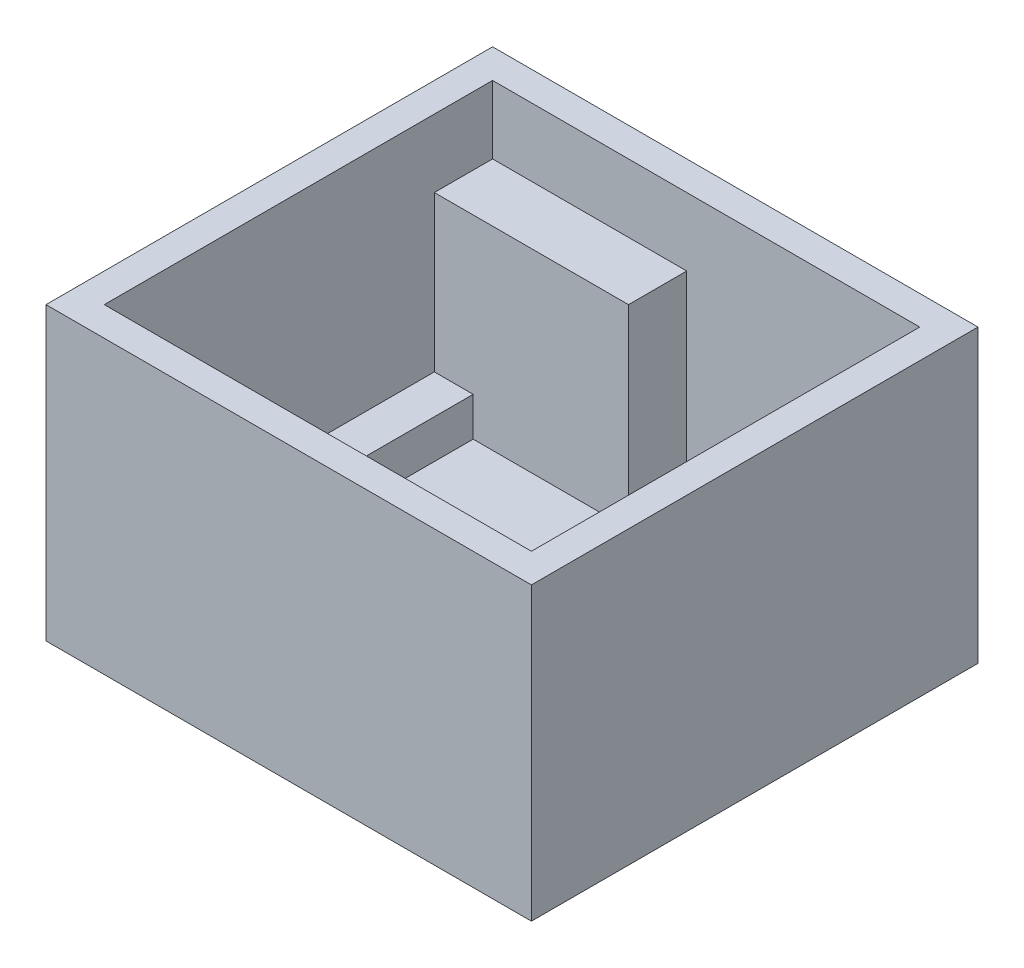
ISO-10303-21;
HEADER;
FILE_DESCRIPTION(('STEP AP214'),'2;1');
FILE_NAME('part.step','',(''),(''),'','','');
FILE_SCHEMA(('AUTOMOTIVE_DESIGN { 1 0 10303 214 1 1 1 1 }'));
ENDSEC;
DATA;
#1=APPLICATION_CONTEXT('core data for automotive mechanical design processes');
#2=APPLICATION_PROTOCOL_DEFINITION('international standard','automotive_design',2000,#1);
#3=PRODUCT_CONTEXT('',#1,'mechanical');
#4=PRODUCT('Part','Part','',(#3));
#5=PRODUCT_RELATED_PRODUCT_CATEGORY('part','',(#4));
#6=PRODUCT_DEFINITION_FORMATION('','',#4);
#7=PRODUCT_DEFINITION_CONTEXT('part definition',#1,'design');
#8=PRODUCT_DEFINITION('design','',#6,#7);
#9=PRODUCT_DEFINITION_SHAPE('','',#8);
#10=(LENGTH_UNIT() NAMED_UNIT(*) SI_UNIT(.MILLI.,.METRE.));
#11=(NAMED_UNIT(*) PLANE_ANGLE_UNIT() SI_UNIT($,.RADIAN.));
#12=(NAMED_UNIT(*) SI_UNIT($,.STERADIAN.) SOLID_ANGLE_UNIT());
#13=UNCERTAINTY_MEASURE_WITH_UNIT(LENGTH_MEASURE(1.E-05),#10,'distance_accuracy_value','');
#14=(GEOMETRIC_REPRESENTATION_CONTEXT(3) GLOBAL_UNCERTAINTY_ASSIGNED_CONTEXT((#13)) GLOBAL_UNIT_ASSIGNED_CONTEXT((#10,
#11,#12)) REPRESENTATION_CONTEXT('',''));
#15=CARTESIAN_POINT('',(0.,0.,0.));
#16=DIRECTION('',(0.,0.,1.));
#17=DIRECTION('',(1.,0.,0.));
#18=AXIS2_PLACEMENT_3D('',#15,#16,#17);
#19=CARTESIAN_POINT('',(11.,3.5,8.00000000000001));
#20=DIRECTION('',(0.,0.,1.));
#21=DIRECTION('',(1.,0.,0.));
#22=AXIS2_PLACEMENT_3D('',#19,#20,#21);
#23=PLANE('',#22);
#24=DIRECTION('',(0.,-1.,0.));
#25=VECTOR('',#24,1.);
#26=CARTESIAN_POINT('',(9.78113883008419,3.5,8.00000000000001));
#27=LINE('',#26,#25);
#28=CARTESIAN_POINT('',(9.78113883008419,3.5,8.00000000000001));
#29=VERTEX_POINT('',#28);
#30=CARTESIAN_POINT('',(9.78113883008419,1.5,8.00000000000001));
#31=VERTEX_POINT('',#30);
#32=EDGE_CURVE('E200',#29,#31,#27,.T.);
#33=ORIENTED_EDGE('',*,*,#32,.F.);
#34=DIRECTION('',(-1.,0.,0.));
#35=VECTOR('',#34,1.);
#36=CARTESIAN_POINT('',(11.,3.5,8.00000000000001));
#37=LINE('',#36,#35);
#38=CARTESIAN_POINT('',(11.,3.5,8.00000000000001));
#39=VERTEX_POINT('',#38);
#40=EDGE_CURVE('E211',#39,#29,#37,.T.);
#41=ORIENTED_EDGE('',*,*,#40,.F.);
#42=DIRECTION('',(0.,-1.,0.));
#43=VECTOR('',#42,1.);
#44=CARTESIAN_POINT('',(11.,3.5,8.00000000000001));
#45=LINE('',#44,#43);
#46=CARTESIAN_POINT('',(11.,1.5,8.00000000000001));
#47=VERTEX_POINT('',#46);
#48=EDGE_CURVE('E235',#39,#47,#45,.T.);
#49=ORIENTED_EDGE('',*,*,#48,.T.);
#50=DIRECTION('',(-1.,0.,0.));
#51=VECTOR('',#50,1.);
#52=CARTESIAN_POINT('',(11.,1.5,8.00000000000001));
#53=LINE('',#52,#51);
#54=EDGE_CURVE('E213',#47,#31,#53,.T.);
#55=ORIENTED_EDGE('',*,*,#54,.T.);
#56=EDGE_LOOP('',(#33,#41,#49,#55));
#57=FACE_BOUND('',#56,.T.);
#58=ADVANCED_FACE('F33',(#57),#23,.F.);
#59=CARTESIAN_POINT('',(9.,3.5,10.));
#60=DIRECTION('',(1.,0.,0.));
#61=DIRECTION('',(0.,0.,-1.));
#62=AXIS2_PLACEMENT_3D('',#59,#60,#61);
#63=PLANE('',#62);
#64=DIRECTION('',(0.,-1.,0.));
#65=VECTOR('',#64,1.);
#66=CARTESIAN_POINT('',(9.,3.5,8.80643824162734));
#67=LINE('',#66,#65);
#68=CARTESIAN_POINT('',(9.,1.5,8.80643824162734));
#69=VERTEX_POINT('',#68);
#70=CARTESIAN_POINT('',(9.,3.5,8.80643824162734));
#71=VERTEX_POINT('',#70);
#72=EDGE_CURVE('E203',#69,#71,#67,.F.);
#73=ORIENTED_EDGE('',*,*,#72,.F.);
#74=DIRECTION('',(0.,0.,1.));
#75=VECTOR('',#74,1.);
#76=CARTESIAN_POINT('',(9.,1.5,10.));
#77=LINE('',#76,#75);
#78=CARTESIAN_POINT('',(9.,1.5,10.));
#79=VERTEX_POINT('',#78);
#80=EDGE_CURVE('E224',#69,#79,#77,.T.);
#81=ORIENTED_EDGE('',*,*,#80,.T.);
#82=DIRECTION('',(0.,-1.,0.));
#83=VECTOR('',#82,1.);
#84=CARTESIAN_POINT('',(9.,3.5,10.));
#85=LINE('',#84,#83);
#86=CARTESIAN_POINT('',(9.,3.5,10.));
#87=VERTEX_POINT('',#86);
#88=EDGE_CURVE('E229',#87,#79,#85,.T.);
#89=ORIENTED_EDGE('',*,*,#88,.F.);
#90=DIRECTION('',(0.,0.,1.));
#91=VECTOR('',#90,1.);
#92=CARTESIAN_POINT('',(9.,3.5,10.));
#93=LINE('',#92,#91);
#94=EDGE_CURVE('E220',#71,#87,#93,.T.);
#95=ORIENTED_EDGE('',*,*,#94,.F.);
#96=EDGE_LOOP('',(#73,#81,#89,#95));
#97=FACE_BOUND('',#96,.T.);
#98=ADVANCED_FACE('F473',(#97),#63,.F.);
#99=CARTESIAN_POINT('',(-9.,3.5,10.));
#100=DIRECTION('',(-1.,0.,0.));
#101=DIRECTION('',(0.,0.,1.));
#102=AXIS2_PLACEMENT_3D('',#99,#100,#101);
#103=PLANE('',#102);
#104=DIRECTION('',(0.,-1.,0.));
#105=VECTOR('',#104,1.);
#106=CARTESIAN_POINT('',(-9.,3.5,8.80643824162734));
#107=LINE('',#106,#105);
#108=CARTESIAN_POINT('',(-9.,3.5,8.80643824162734));
#109=VERTEX_POINT('',#108);
#110=CARTESIAN_POINT('',(-9.,1.5,8.80643824162734));
#111=VERTEX_POINT('',#110);
#112=EDGE_CURVE('E382',#109,#111,#107,.T.);
#113=ORIENTED_EDGE('',*,*,#112,.F.);
#114=DIRECTION('',(0.,0.,-1.));
#115=VECTOR('',#114,1.);
#116=CARTESIAN_POINT('',(-9.,3.5,10.));
#117=LINE('',#116,#115);
#118=CARTESIAN_POINT('',(-9.,3.5,10.));
#119=VERTEX_POINT('',#118);
#120=EDGE_CURVE('E360',#119,#109,#117,.T.);
#121=ORIENTED_EDGE('',*,*,#120,.F.);
#122=DIRECTION('',(0.,-1.,0.));
#123=VECTOR('',#122,1.);
#124=CARTESIAN_POINT('',(-9.,3.5,10.));
#125=LINE('',#124,#123);
#126=CARTESIAN_POINT('',(-9.,1.5,10.));
#127=VERTEX_POINT('',#126);
#128=EDGE_CURVE('E231',#119,#127,#125,.T.);
#129=ORIENTED_EDGE('',*,*,#128,.T.);
#130=DIRECTION('',(0.,0.,-1.));
#131=VECTOR('',#130,1.);
#132=CARTESIAN_POINT('',(-9.,1.5,10.));
#133=LINE('',#132,#131);
#134=EDGE_CURVE('E375',#127,#111,#133,.T.);
#135=ORIENTED_EDGE('',*,*,#134,.T.);
#136=EDGE_LOOP('',(#113,#121,#129,#135));
#137=FACE_BOUND('',#136,.T.);
#138=ADVANCED_FACE('F381',(#137),#103,.F.);
#139=CARTESIAN_POINT('',(-11.,3.5,8.00000000000001));
#140=DIRECTION('',(0.,0.,1.));
#141=DIRECTION('',(1.,0.,0.));
#142=AXIS2_PLACEMENT_3D('',#139,#140,#141);
#143=PLANE('',#142);
#144=DIRECTION('',(0.,-1.,0.));
#145=VECTOR('',#144,1.);
#146=CARTESIAN_POINT('',(-9.78113883008418,3.5,8.00000000000001));
#147=LINE('',#146,#145);
#148=CARTESIAN_POINT('',(-9.78113883008418,1.5,8.00000000000001));
#149=VERTEX_POINT('',#148);
#150=CARTESIAN_POINT('',(-9.78113883008418,3.5,8.00000000000001));
#151=VERTEX_POINT('',#150);
#152=EDGE_CURVE('E429',#149,#151,#147,.F.);
#153=ORIENTED_EDGE('',*,*,#152,.F.);
#154=DIRECTION('',(-1.,0.,0.));
#155=VECTOR('',#154,1.);
#156=CARTESIAN_POINT('',(-11.,1.5,8.00000000000001));
#157=LINE('',#156,#155);
#158=CARTESIAN_POINT('',(-11.,1.5,8.00000000000001));
#159=VERTEX_POINT('',#158);
#160=EDGE_CURVE('E361',#149,#159,#157,.T.);
#161=ORIENTED_EDGE('',*,*,#160,.T.);
#162=DIRECTION('',(0.,-1.,0.));
#163=VECTOR('',#162,1.);
#164=CARTESIAN_POINT('',(-11.,3.5,8.00000000000001));
#165=LINE('',#164,#163);
#166=CARTESIAN_POINT('',(-11.,3.5,8.00000000000001));
#167=VERTEX_POINT('',#166);
#168=EDGE_CURVE('E369',#167,#159,#165,.T.);
#169=ORIENTED_EDGE('',*,*,#168,.F.);
#170=DIRECTION('',(-1.,0.,0.));
#171=VECTOR('',#170,1.);
#172=CARTESIAN_POINT('',(-11.,3.5,8.00000000000001));
#173=LINE('',#172,#171);
#174=EDGE_CURVE('E366',#151,#167,#173,.T.);
#175=ORIENTED_EDGE('',*,*,#174,.F.);
#176=EDGE_LOOP('',(#153,#161,#169,#175));
#177=FACE_BOUND('',#176,.T.);
#178=ADVANCED_FACE('F505',(#177),#143,.F.);
#179=CARTESIAN_POINT('',(0.,1.5,0.));
#180=DIRECTION('',(0.,-1.,0.));
#181=DIRECTION('',(0.,0.,-1.));
#182=AXIS2_PLACEMENT_3D('',#179,#180,#181);
#183=PLANE('',#182);
#184=CARTESIAN_POINT('',(8.2,1.5,7.25));
#185=DIRECTION('',(0.,1.,0.));
#186=DIRECTION('',(0.,0.,-1.));
#187=AXIS2_PLACEMENT_3D('',#184,#185,#186);
#188=CIRCLE('',#187,1.75);
#189=EDGE_CURVE('E205',#31,#69,#188,.T.);
#190=ORIENTED_EDGE('',*,*,#189,.F.);
#191=ORIENTED_EDGE('',*,*,#54,.F.);
#192=DIRECTION('',(0.,0.,-1.));
#193=VECTOR('',#192,1.);
#194=CARTESIAN_POINT('',(11.,1.5,0.));
#195=LINE('',#194,#193);
#196=CARTESIAN_POINT('',(11.,1.5,-1.));
#197=VERTEX_POINT('',#196);
#198=EDGE_CURVE('E273',#47,#197,#195,.T.);
#199=ORIENTED_EDGE('',*,*,#198,.T.);
#200=DIRECTION('',(1.,0.,0.));
#201=VECTOR('',#200,1.);
#202=CARTESIAN_POINT('',(9.,1.5,-1.));
#203=LINE('',#202,#201);
#204=CARTESIAN_POINT('',(9.,1.5,-1.));
#205=VERTEX_POINT('',#204);
#206=EDGE_CURVE('E398',#205,#197,#203,.T.);
#207=ORIENTED_EDGE('',*,*,#206,.F.);
#208=DIRECTION('',(0.,0.,1.));
#209=VECTOR('',#208,1.);
#210=CARTESIAN_POINT('',(9.,1.5,-10.));
#211=LINE('',#210,#209);
#212=CARTESIAN_POINT('',(9.,1.5,-10.));
#213=VERTEX_POINT('',#212);
#214=EDGE_CURVE('E237',#213,#205,#211,.T.);
#215=ORIENTED_EDGE('',*,*,#214,.F.);
#216=DIRECTION('',(-1.,0.,0.));
#217=VECTOR('',#216,1.);
#218=CARTESIAN_POINT('',(0.,1.5,-10.));
#219=LINE('',#218,#217);
#220=CARTESIAN_POINT('',(-0.999999999999997,1.5,-10.));
#221=VERTEX_POINT('',#220);
#222=EDGE_CURVE('E277',#213,#221,#219,.T.);
#223=ORIENTED_EDGE('',*,*,#222,.T.);
#224=DIRECTION('',(0.,0.,-1.));
#225=VECTOR('',#224,1.);
#226=CARTESIAN_POINT('',(-0.999999999999997,1.5,-10.));
#227=LINE('',#226,#225);
#228=CARTESIAN_POINT('',(-0.999999999999997,1.5,-7.));
#229=VERTEX_POINT('',#228);
#230=EDGE_CURVE('E416',#229,#221,#227,.T.);
#231=ORIENTED_EDGE('',*,*,#230,.F.);
#232=DIRECTION('',(1.,0.,0.));
#233=VECTOR('',#232,1.);
#234=CARTESIAN_POINT('',(-11.,1.5,-7.));
#235=LINE('',#234,#233);
#236=CARTESIAN_POINT('',(-9.,1.5,-7.));
#237=VERTEX_POINT('',#236);
#238=EDGE_CURVE('E419',#237,#229,#235,.T.);
#239=ORIENTED_EDGE('',*,*,#238,.F.);
#240=DIRECTION('',(0.,0.,-1.));
#241=VECTOR('',#240,1.);
#242=CARTESIAN_POINT('',(-9.,1.5,-10.));
#243=LINE('',#242,#241);
#244=CARTESIAN_POINT('',(-9.,1.5,-1.00000000000001));
#245=VERTEX_POINT('',#244);
#246=EDGE_CURVE('E250',#245,#237,#243,.T.);
#247=ORIENTED_EDGE('',*,*,#246,.F.);
#248=DIRECTION('',(1.,0.,0.));
#249=VECTOR('',#248,1.);
#250=CARTESIAN_POINT('',(-9.,1.5,-1.00000000000001));
#251=LINE('',#250,#249);
#252=CARTESIAN_POINT('',(-11.,1.5,-1.00000000000001));
#253=VERTEX_POINT('',#252);
#254=EDGE_CURVE('E390',#253,#245,#251,.T.);
#255=ORIENTED_EDGE('',*,*,#254,.F.);
#256=DIRECTION('',(0.,0.,1.));
#257=VECTOR('',#256,1.);
#258=CARTESIAN_POINT('',(-11.,1.5,0.));
#259=LINE('',#258,#257);
#260=EDGE_CURVE('E256',#253,#159,#259,.T.);
#261=ORIENTED_EDGE('',*,*,#260,.T.);
#262=ORIENTED_EDGE('',*,*,#160,.F.);
#263=CARTESIAN_POINT('',(-8.2,1.5,7.25));
#264=DIRECTION('',(0.,1.,0.));
#265=DIRECTION('',(0.,0.,1.));
#266=AXIS2_PLACEMENT_3D('',#263,#264,#265);
#267=CIRCLE('',#266,1.75);
#268=EDGE_CURVE('E214',#111,#149,#267,.T.);
#269=ORIENTED_EDGE('',*,*,#268,.F.);
#270=ORIENTED_EDGE('',*,*,#134,.F.);
#271=DIRECTION('',(1.,0.,0.));
#272=VECTOR('',#271,1.);
#273=CARTESIAN_POINT('',(0.,1.5,10.));
#274=LINE('',#273,#272);
#275=EDGE_CURVE('E261',#127,#79,#274,.T.);
#276=ORIENTED_EDGE('',*,*,#275,.T.);
#277=ORIENTED_EDGE('',*,*,#80,.F.);
#278=EDGE_LOOP('',(#190,#191,#199,#207,#215,#223,#231,#239,#247,#255,#261,#262,#269,#270,#276,#277));
#279=FACE_BOUND('',#278,.T.);
#280=ADVANCED_FACE('F495',(#279),#183,.F.);
#281=CARTESIAN_POINT('',(-11.,15.,11.5));
#282=DIRECTION('',(1.,0.,0.));
#283=DIRECTION('',(0.,0.,-1.));
#284=AXIS2_PLACEMENT_3D('',#281,#282,#283);
#285=PLANE('',#284);
#286=DIRECTION('',(0.,0.,1.));
#287=VECTOR('',#286,1.);
#288=CARTESIAN_POINT('',(-11.,3.5,-10.));
#289=LINE('',#288,#287);
#290=CARTESIAN_POINT('',(-11.,3.5,-7.));
#291=VERTEX_POINT('',#290);
#292=CARTESIAN_POINT('',(-11.,3.5,-1.00000000000001));
#293=VERTEX_POINT('',#292);
#294=EDGE_CURVE('E251',#291,#293,#289,.T.);
#295=ORIENTED_EDGE('',*,*,#294,.F.);
#296=DIRECTION('',(0.,-1.,0.));
#297=VECTOR('',#296,1.);
#298=CARTESIAN_POINT('',(-11.,11.5,-7.));
#299=LINE('',#298,#297);
#300=CARTESIAN_POINT('',(-11.,11.5,-7.));
#301=VERTEX_POINT('',#300);
#302=EDGE_CURVE('E407',#301,#291,#299,.T.);
#303=ORIENTED_EDGE('',*,*,#302,.F.);
#304=DIRECTION('',(0.,0.,1.));
#305=VECTOR('',#304,1.);
#306=CARTESIAN_POINT('',(-11.,11.5,-10.));
#307=LINE('',#306,#305);
#308=CARTESIAN_POINT('',(-11.,11.5,-10.));
#309=VERTEX_POINT('',#308);
#310=EDGE_CURVE('E418',#309,#301,#307,.T.);
#311=ORIENTED_EDGE('',*,*,#310,.F.);
#312=DIRECTION('',(0.,-1.,0.));
#313=VECTOR('',#312,1.);
#314=CARTESIAN_POINT('',(-11.,15.,-10.));
#315=LINE('',#314,#313);
#316=CARTESIAN_POINT('',(-11.,15.,-10.));
#317=VERTEX_POINT('',#316);
#318=EDGE_CURVE('E266',#317,#309,#315,.T.);
#319=ORIENTED_EDGE('',*,*,#318,.F.);
#320=DIRECTION('',(0.,0.,1.));
#321=VECTOR('',#320,1.);
#322=CARTESIAN_POINT('',(-11.,15.,0.));
#323=LINE('',#322,#321);
#324=CARTESIAN_POINT('',(-11.,15.,10.));
#325=VERTEX_POINT('',#324);
#326=EDGE_CURVE('E281',#317,#325,#323,.T.);
#327=ORIENTED_EDGE('',*,*,#326,.T.);
#328=DIRECTION('',(0.,-1.,0.));
#329=VECTOR('',#328,1.);
#330=CARTESIAN_POINT('',(-11.,15.,10.));
#331=LINE('',#330,#329);
#332=CARTESIAN_POINT('',(-11.,3.5,10.));
#333=VERTEX_POINT('',#332);
#334=EDGE_CURVE('E262',#325,#333,#331,.T.);
#335=ORIENTED_EDGE('',*,*,#334,.T.);
#336=DIRECTION('',(0.,0.,1.));
#337=VECTOR('',#336,1.);
#338=CARTESIAN_POINT('',(-11.,3.5,10.));
#339=LINE('',#338,#337);
#340=EDGE_CURVE('E363',#167,#333,#339,.T.);
#341=ORIENTED_EDGE('',*,*,#340,.F.);
#342=ORIENTED_EDGE('',*,*,#168,.T.);
#343=ORIENTED_EDGE('',*,*,#260,.F.);
#344=DIRECTION('',(0.,-1.,0.));
#345=VECTOR('',#344,1.);
#346=CARTESIAN_POINT('',(-11.,10.7801098892805,-1.00000000000001));
#347=LINE('',#346,#345);
#348=EDGE_CURVE('E387',#293,#253,#347,.T.);
#349=ORIENTED_EDGE('',*,*,#348,.F.);
#350=EDGE_LOOP('',(#295,#303,#311,#319,#327,#335,#341,#342,#343,#349));
#351=FACE_BOUND('',#350,.T.);
#352=ADVANCED_FACE('F348',(#351),#285,.T.);
#353=CARTESIAN_POINT('',(-12.5,15.,-10.));
#354=DIRECTION('',(0.,0.,1.));
#355=DIRECTION('',(1.,0.,0.));
#356=AXIS2_PLACEMENT_3D('',#353,#354,#355);
#357=PLANE('',#356);
#358=DIRECTION('',(-1.,0.,0.));
#359=VECTOR('',#358,1.);
#360=CARTESIAN_POINT('',(-11.,11.5,-10.));
#361=LINE('',#360,#359);
#362=CARTESIAN_POINT('',(-0.999999999999997,11.5,-10.));
#363=VERTEX_POINT('',#362);
#364=EDGE_CURVE('E415',#363,#309,#361,.T.);
#365=ORIENTED_EDGE('',*,*,#364,.F.);
#366=DIRECTION('',(0.,-1.,0.));
#367=VECTOR('',#366,1.);
#368=CARTESIAN_POINT('',(-0.999999999999997,11.5,-10.));
#369=LINE('',#368,#367);
#370=EDGE_CURVE('E412',#363,#221,#369,.T.);
#371=ORIENTED_EDGE('',*,*,#370,.T.);
#372=ORIENTED_EDGE('',*,*,#222,.F.);
#373=DIRECTION('',(0.,-1.,0.));
#374=VECTOR('',#373,1.);
#375=CARTESIAN_POINT('',(9.,3.5,-10.));
#376=LINE('',#375,#374);
#377=CARTESIAN_POINT('',(9.,3.5,-10.));
#378=VERTEX_POINT('',#377);
#379=EDGE_CURVE('E246',#378,#213,#376,.T.);
#380=ORIENTED_EDGE('',*,*,#379,.F.);
#381=DIRECTION('',(-1.,0.,0.));
#382=VECTOR('',#381,1.);
#383=CARTESIAN_POINT('',(11.,3.5,-10.));
#384=LINE('',#383,#382);
#385=CARTESIAN_POINT('',(11.,3.5,-10.));
#386=VERTEX_POINT('',#385);
#387=EDGE_CURVE('E238',#386,#378,#384,.T.);
#388=ORIENTED_EDGE('',*,*,#387,.F.);
#389=DIRECTION('',(0.,-1.,0.));
#390=VECTOR('',#389,1.);
#391=CARTESIAN_POINT('',(11.,15.,-10.));
#392=LINE('',#391,#390);
#393=CARTESIAN_POINT('',(11.,15.,-10.));
#394=VERTEX_POINT('',#393);
#395=EDGE_CURVE('E269',#394,#386,#392,.T.);
#396=ORIENTED_EDGE('',*,*,#395,.F.);
#397=DIRECTION('',(-1.,0.,0.));
#398=VECTOR('',#397,1.);
#399=CARTESIAN_POINT('',(0.,15.,-10.));
#400=LINE('',#399,#398);
#401=EDGE_CURVE('E270',#394,#317,#400,.T.);
#402=ORIENTED_EDGE('',*,*,#401,.T.);
#403=ORIENTED_EDGE('',*,*,#318,.T.);
#404=EDGE_LOOP('',(#365,#371,#372,#380,#388,#396,#402,#403));
#405=FACE_BOUND('',#404,.T.);
#406=ADVANCED_FACE('F491',(#405),#357,.T.);
#407=CARTESIAN_POINT('',(-9.,3.5,-10.));
#408=DIRECTION('',(-1.,0.,0.));
#409=DIRECTION('',(0.,0.,1.));
#410=AXIS2_PLACEMENT_3D('',#407,#408,#409);
#411=PLANE('',#410);
#412=DIRECTION('',(0.,-1.,0.));
#413=VECTOR('',#412,1.);
#414=CARTESIAN_POINT('',(-9.,3.5,-7.));
#415=LINE('',#414,#413);
#416=CARTESIAN_POINT('',(-9.,3.5,-7.));
#417=VERTEX_POINT('',#416);
#418=EDGE_CURVE('E402',#417,#237,#415,.T.);
#419=ORIENTED_EDGE('',*,*,#418,.F.);
#420=DIRECTION('',(0.,0.,-1.));
#421=VECTOR('',#420,1.);
#422=CARTESIAN_POINT('',(-9.,3.5,-10.));
#423=LINE('',#422,#421);
#424=CARTESIAN_POINT('',(-9.,3.5,-1.00000000000001));
#425=VERTEX_POINT('',#424);
#426=EDGE_CURVE('E253',#425,#417,#423,.T.);
#427=ORIENTED_EDGE('',*,*,#426,.F.);
#428=DIRECTION('',(0.,-1.,0.));
#429=VECTOR('',#428,1.);
#430=CARTESIAN_POINT('',(-9.,10.7801098892805,-1.00000000000001));
#431=LINE('',#430,#429);
#432=EDGE_CURVE('E384',#425,#245,#431,.T.);
#433=ORIENTED_EDGE('',*,*,#432,.T.);
#434=ORIENTED_EDGE('',*,*,#246,.T.);
#435=EDGE_LOOP('',(#419,#427,#433,#434));
#436=FACE_BOUND('',#435,.T.);
#437=ADVANCED_FACE('F487',(#436),#411,.F.);
#438=CARTESIAN_POINT('',(0.,3.5,0.));
#439=DIRECTION('',(0.,1.,0.));
#440=DIRECTION('',(0.,0.,1.));
#441=AXIS2_PLACEMENT_3D('',#438,#439,#440);
#442=PLANE('',#441);
#443=ORIENTED_EDGE('',*,*,#426,.T.);
#444=DIRECTION('',(-1.,0.,0.));
#445=VECTOR('',#444,1.);
#446=CARTESIAN_POINT('',(0.,3.5,-7.));
#447=LINE('',#446,#445);
#448=EDGE_CURVE('E11',#417,#291,#447,.T.);
#449=ORIENTED_EDGE('',*,*,#448,.T.);
#450=ORIENTED_EDGE('',*,*,#294,.T.);
#451=DIRECTION('',(1.,0.,0.));
#452=VECTOR('',#451,1.);
#453=CARTESIAN_POINT('',(-9.,3.5,-1.00000000000001));
#454=LINE('',#453,#452);
#455=EDGE_CURVE('E378',#293,#425,#454,.T.);
#456=ORIENTED_EDGE('',*,*,#455,.T.);
#457=EDGE_LOOP('',(#443,#449,#450,#456));
#458=FACE_BOUND('',#457,.T.);
#459=ADVANCED_FACE('F483',(#458),#442,.T.);
#460=CARTESIAN_POINT('',(11.,15.,11.5));
#461=DIRECTION('',(-1.,0.,0.));
#462=DIRECTION('',(0.,0.,1.));
#463=AXIS2_PLACEMENT_3D('',#460,#461,#462);
#464=PLANE('',#463);
#465=DIRECTION('',(0.,0.,-1.));
#466=VECTOR('',#465,1.);
#467=CARTESIAN_POINT('',(11.,3.5,-10.));
#468=LINE('',#467,#466);
#469=CARTESIAN_POINT('',(11.,3.5,-1.));
#470=VERTEX_POINT('',#469);
#471=EDGE_CURVE('E243',#470,#386,#468,.T.);
#472=ORIENTED_EDGE('',*,*,#471,.F.);
#473=DIRECTION('',(0.,-1.,0.));
#474=VECTOR('',#473,1.);
#475=CARTESIAN_POINT('',(11.,10.7801098892805,-1.));
#476=LINE('',#475,#474);
#477=EDGE_CURVE('E395',#470,#197,#476,.T.);
#478=ORIENTED_EDGE('',*,*,#477,.T.);
#479=ORIENTED_EDGE('',*,*,#198,.F.);
#480=ORIENTED_EDGE('',*,*,#48,.F.);
#481=DIRECTION('',(0.,0.,-1.));
#482=VECTOR('',#481,1.);
#483=CARTESIAN_POINT('',(11.,3.5,10.));
#484=LINE('',#483,#482);
#485=CARTESIAN_POINT('',(11.,3.5,10.));
#486=VERTEX_POINT('',#485);
#487=EDGE_CURVE('E219',#486,#39,#484,.T.);
#488=ORIENTED_EDGE('',*,*,#487,.F.);
#489=DIRECTION('',(0.,-1.,0.));
#490=VECTOR('',#489,1.);
#491=CARTESIAN_POINT('',(11.,15.,10.));
#492=LINE('',#491,#490);
#493=CARTESIAN_POINT('',(11.,15.,10.));
#494=VERTEX_POINT('',#493);
#495=EDGE_CURVE('E265',#494,#486,#492,.T.);
#496=ORIENTED_EDGE('',*,*,#495,.F.);
#497=DIRECTION('',(0.,0.,-1.));
#498=VECTOR('',#497,1.);
#499=CARTESIAN_POINT('',(11.,15.,0.));
#500=LINE('',#499,#498);
#501=EDGE_CURVE('E285',#494,#394,#500,.T.);
#502=ORIENTED_EDGE('',*,*,#501,.T.);
#503=ORIENTED_EDGE('',*,*,#395,.T.);
#504=EDGE_LOOP('',(#472,#478,#479,#480,#488,#496,#502,#503));
#505=FACE_BOUND('',#504,.T.);
#506=ADVANCED_FACE('F486',(#505),#464,.T.);
#507=CARTESIAN_POINT('',(-12.5,15.,10.));
#508=DIRECTION('',(0.,0.,-1.));
#509=DIRECTION('',(-1.,0.,0.));
#510=AXIS2_PLACEMENT_3D('',#507,#508,#509);
#511=PLANE('',#510);
#512=ORIENTED_EDGE('',*,*,#275,.F.);
#513=ORIENTED_EDGE('',*,*,#128,.F.);
#514=DIRECTION('',(1.,0.,0.));
#515=VECTOR('',#514,1.);
#516=CARTESIAN_POINT('',(-11.,3.5,10.));
#517=LINE('',#516,#515);
#518=EDGE_CURVE('E356',#333,#119,#517,.T.);
#519=ORIENTED_EDGE('',*,*,#518,.F.);
#520=ORIENTED_EDGE('',*,*,#334,.F.);
#521=DIRECTION('',(1.,0.,0.));
#522=VECTOR('',#521,1.);
#523=CARTESIAN_POINT('',(0.,15.,10.));
#524=LINE('',#523,#522);
#525=EDGE_CURVE('E283',#325,#494,#524,.T.);
#526=ORIENTED_EDGE('',*,*,#525,.T.);
#527=ORIENTED_EDGE('',*,*,#495,.T.);
#528=DIRECTION('',(1.,0.,0.));
#529=VECTOR('',#528,1.);
#530=CARTESIAN_POINT('',(11.,3.5,10.));
#531=LINE('',#530,#529);
#532=EDGE_CURVE('E222',#87,#486,#531,.T.);
#533=ORIENTED_EDGE('',*,*,#532,.F.);
#534=ORIENTED_EDGE('',*,*,#88,.T.);
#535=EDGE_LOOP('',(#512,#513,#519,#520,#526,#527,#533,#534));
#536=FACE_BOUND('',#535,.T.);
#537=ADVANCED_FACE('F338',(#536),#511,.T.);
#538=CARTESIAN_POINT('',(0.,15.,0.));
#539=DIRECTION('',(0.,-1.,0.));
#540=DIRECTION('',(0.,0.,-1.));
#541=AXIS2_PLACEMENT_3D('',#538,#539,#540);
#542=PLANE('',#541);
#543=DIRECTION('',(0.,0.,1.));
#544=VECTOR('',#543,1.);
#545=CARTESIAN_POINT('',(-12.5,15.,11.5));
#546=LINE('',#545,#544);
#547=CARTESIAN_POINT('',(-12.5,15.,-11.5));
#548=VERTEX_POINT('',#547);
#549=CARTESIAN_POINT('',(-12.5,15.,11.5));
#550=VERTEX_POINT('',#549);
#551=EDGE_CURVE('E289',#548,#550,#546,.T.);
#552=ORIENTED_EDGE('',*,*,#551,.T.);
#553=DIRECTION('',(1.,0.,0.));
#554=VECTOR('',#553,1.);
#555=CARTESIAN_POINT('',(-12.5,15.,11.5));
#556=LINE('',#555,#554);
#557=CARTESIAN_POINT('',(12.5,15.,11.5));
#558=VERTEX_POINT('',#557);
#559=EDGE_CURVE('E292',#550,#558,#556,.T.);
#560=ORIENTED_EDGE('',*,*,#559,.T.);
#561=DIRECTION('',(0.,0.,-1.));
#562=VECTOR('',#561,1.);
#563=CARTESIAN_POINT('',(12.5,15.,11.5));
#564=LINE('',#563,#562);
#565=CARTESIAN_POINT('',(12.5,15.,-11.5));
#566=VERTEX_POINT('',#565);
#567=EDGE_CURVE('E295',#558,#566,#564,.T.);
#568=ORIENTED_EDGE('',*,*,#567,.T.);
#569=DIRECTION('',(-1.,0.,0.));
#570=VECTOR('',#569,1.);
#571=CARTESIAN_POINT('',(-12.5,15.,-11.5));
#572=LINE('',#571,#570);
#573=EDGE_CURVE('E297',#566,#548,#572,.T.);
#574=ORIENTED_EDGE('',*,*,#573,.T.);
#575=EDGE_LOOP('',(#552,#560,#568,#574));
#576=FACE_BOUND('',#575,.T.);
#577=ORIENTED_EDGE('',*,*,#326,.F.);
#578=ORIENTED_EDGE('',*,*,#401,.F.);
#579=ORIENTED_EDGE('',*,*,#501,.F.);
#580=ORIENTED_EDGE('',*,*,#525,.F.);
#581=EDGE_LOOP('',(#577,#578,#579,#580));
#582=FACE_BOUND('',#581,.T.);
#583=ADVANCED_FACE('F335',(#576,#582),#542,.F.);
#584=CARTESIAN_POINT('',(-12.5,15.,11.5));
#585=DIRECTION('',(1.,0.,0.));
#586=DIRECTION('',(0.,0.,-1.));
#587=AXIS2_PLACEMENT_3D('',#584,#585,#586);
#588=PLANE('',#587);
#589=DIRECTION('',(0.,0.,1.));
#590=VECTOR('',#589,1.);
#591=CARTESIAN_POINT('',(-12.5,0.,11.5));
#592=LINE('',#591,#590);
#593=CARTESIAN_POINT('',(-12.5,0.,-11.5));
#594=VERTEX_POINT('',#593);
#595=CARTESIAN_POINT('',(-12.5,0.,11.5));
#596=VERTEX_POINT('',#595);
#597=EDGE_CURVE('E264',#594,#596,#592,.T.);
#598=ORIENTED_EDGE('',*,*,#597,.T.);
#599=DIRECTION('',(0.,-1.,0.));
#600=VECTOR('',#599,1.);
#601=CARTESIAN_POINT('',(-12.5,15.,11.5));
#602=LINE('',#601,#600);
#603=EDGE_CURVE('E41',#550,#596,#602,.T.);
#604=ORIENTED_EDGE('',*,*,#603,.F.);
#605=ORIENTED_EDGE('',*,*,#551,.F.);
#606=DIRECTION('',(0.,-1.,0.));
#607=VECTOR('',#606,1.);
#608=CARTESIAN_POINT('',(-12.5,15.,-11.5));
#609=LINE('',#608,#607);
#610=EDGE_CURVE('E299',#548,#594,#609,.T.);
#611=ORIENTED_EDGE('',*,*,#610,.T.);
#612=EDGE_LOOP('',(#598,#604,#605,#611));
#613=FACE_BOUND('',#612,.T.);
#614=ADVANCED_FACE('F35',(#613),#588,.F.);
#615=CARTESIAN_POINT('',(-12.5,15.,11.5));
#616=DIRECTION('',(0.,0.,-1.));
#617=DIRECTION('',(-1.,0.,0.));
#618=AXIS2_PLACEMENT_3D('',#615,#616,#617);
#619=PLANE('',#618);
#620=DIRECTION('',(1.,0.,0.));
#621=VECTOR('',#620,1.);
#622=CARTESIAN_POINT('',(-12.5,0.,11.5));
#623=LINE('',#622,#621);
#624=CARTESIAN_POINT('',(12.5,0.,11.5));
#625=VERTEX_POINT('',#624);
#626=EDGE_CURVE('E302',#596,#625,#623,.T.);
#627=ORIENTED_EDGE('',*,*,#626,.T.);
#628=DIRECTION('',(0.,-1.,0.));
#629=VECTOR('',#628,1.);
#630=CARTESIAN_POINT('',(12.5,15.,11.5));
#631=LINE('',#630,#629);
#632=EDGE_CURVE('E312',#558,#625,#631,.T.);
#633=ORIENTED_EDGE('',*,*,#632,.F.);
#634=ORIENTED_EDGE('',*,*,#559,.F.);
#635=ORIENTED_EDGE('',*,*,#603,.T.);
#636=EDGE_LOOP('',(#627,#633,#634,#635));
#637=FACE_BOUND('',#636,.T.);
#638=ADVANCED_FACE('F317',(#637),#619,.F.);
#639=CARTESIAN_POINT('',(12.5,15.,11.5));
#640=DIRECTION('',(-1.,0.,0.));
#641=DIRECTION('',(0.,0.,1.));
#642=AXIS2_PLACEMENT_3D('',#639,#640,#641);
#643=PLANE('',#642);
#644=DIRECTION('',(0.,0.,-1.));
#645=VECTOR('',#644,1.);
#646=CARTESIAN_POINT('',(12.5,0.,11.5));
#647=LINE('',#646,#645);
#648=CARTESIAN_POINT('',(12.5,0.,-11.5));
#649=VERTEX_POINT('',#648);
#650=EDGE_CURVE('E304',#625,#649,#647,.T.);
#651=ORIENTED_EDGE('',*,*,#650,.T.);
#652=DIRECTION('',(0.,-1.,0.));
#653=VECTOR('',#652,1.);
#654=CARTESIAN_POINT('',(12.5,15.,-11.5));
#655=LINE('',#654,#653);
#656=EDGE_CURVE('E309',#566,#649,#655,.T.);
#657=ORIENTED_EDGE('',*,*,#656,.F.);
#658=ORIENTED_EDGE('',*,*,#567,.F.);
#659=ORIENTED_EDGE('',*,*,#632,.T.);
#660=EDGE_LOOP('',(#651,#657,#658,#659));
#661=FACE_BOUND('',#660,.T.);
#662=ADVANCED_FACE('F329',(#661),#643,.F.);
#663=CARTESIAN_POINT('',(-12.5,15.,-11.5));
#664=DIRECTION('',(0.,0.,1.));
#665=DIRECTION('',(1.,0.,0.));
#666=AXIS2_PLACEMENT_3D('',#663,#664,#665);
#667=PLANE('',#666);
#668=DIRECTION('',(-1.,0.,0.));
#669=VECTOR('',#668,1.);
#670=CARTESIAN_POINT('',(-12.5,0.,-11.5));
#671=LINE('',#670,#669);
#672=EDGE_CURVE('E293',#649,#594,#671,.T.);
#673=ORIENTED_EDGE('',*,*,#672,.T.);
#674=ORIENTED_EDGE('',*,*,#610,.F.);
#675=ORIENTED_EDGE('',*,*,#573,.F.);
#676=ORIENTED_EDGE('',*,*,#656,.T.);
#677=EDGE_LOOP('',(#673,#674,#675,#676));
#678=FACE_BOUND('',#677,.T.);
#679=ADVANCED_FACE('F333',(#678),#667,.F.);
#680=CARTESIAN_POINT('',(0.,0.,0.));
#681=DIRECTION('',(0.,-1.,0.));
#682=DIRECTION('',(0.,0.,-1.));
#683=AXIS2_PLACEMENT_3D('',#680,#681,#682);
#684=PLANE('',#683);
#685=ORIENTED_EDGE('',*,*,#597,.F.);
#686=ORIENTED_EDGE('',*,*,#672,.F.);
#687=ORIENTED_EDGE('',*,*,#650,.F.);
#688=ORIENTED_EDGE('',*,*,#626,.F.);
#689=EDGE_LOOP('',(#685,#686,#687,#688));
#690=FACE_BOUND('',#689,.T.);
#691=ADVANCED_FACE('F325',(#690),#684,.T.);
#692=CARTESIAN_POINT('',(9.,3.5,-10.));
#693=DIRECTION('',(1.,0.,0.));
#694=DIRECTION('',(0.,0.,-1.));
#695=AXIS2_PLACEMENT_3D('',#692,#693,#694);
#696=PLANE('',#695);
#697=ORIENTED_EDGE('',*,*,#214,.T.);
#698=DIRECTION('',(0.,-1.,0.));
#699=VECTOR('',#698,1.);
#700=CARTESIAN_POINT('',(9.,10.7801098892805,-1.));
#701=LINE('',#700,#699);
#702=CARTESIAN_POINT('',(9.,3.5,-1.));
#703=VERTEX_POINT('',#702);
#704=EDGE_CURVE('E399',#703,#205,#701,.T.);
#705=ORIENTED_EDGE('',*,*,#704,.F.);
#706=DIRECTION('',(0.,0.,1.));
#707=VECTOR('',#706,1.);
#708=CARTESIAN_POINT('',(9.,3.5,-10.));
#709=LINE('',#708,#707);
#710=EDGE_CURVE('E241',#378,#703,#709,.T.);
#711=ORIENTED_EDGE('',*,*,#710,.F.);
#712=ORIENTED_EDGE('',*,*,#379,.T.);
#713=EDGE_LOOP('',(#697,#705,#711,#712));
#714=FACE_BOUND('',#713,.T.);
#715=ADVANCED_FACE('F467',(#714),#696,.F.);
#716=CARTESIAN_POINT('',(0.,3.5,0.));
#717=DIRECTION('',(0.,1.,0.));
#718=DIRECTION('',(0.,0.,1.));
#719=AXIS2_PLACEMENT_3D('',#716,#717,#718);
#720=PLANE('',#719);
#721=ORIENTED_EDGE('',*,*,#387,.T.);
#722=ORIENTED_EDGE('',*,*,#710,.T.);
#723=DIRECTION('',(1.,0.,0.));
#724=VECTOR('',#723,1.);
#725=CARTESIAN_POINT('',(9.,3.5,-1.));
#726=LINE('',#725,#724);
#727=EDGE_CURVE('E388',#703,#470,#726,.T.);
#728=ORIENTED_EDGE('',*,*,#727,.T.);
#729=ORIENTED_EDGE('',*,*,#471,.T.);
#730=EDGE_LOOP('',(#721,#722,#728,#729));
#731=FACE_BOUND('',#730,.T.);
#732=ADVANCED_FACE('F458',(#731),#720,.T.);
#733=CARTESIAN_POINT('',(0.,3.5,0.));
#734=DIRECTION('',(0.,1.,0.));
#735=DIRECTION('',(0.,0.,1.));
#736=AXIS2_PLACEMENT_3D('',#733,#734,#735);
#737=PLANE('',#736);
#738=CARTESIAN_POINT('',(8.2,3.5,7.25));
#739=DIRECTION('',(0.,1.,0.));
#740=DIRECTION('',(0.,0.,1.));
#741=AXIS2_PLACEMENT_3D('',#738,#739,#740);
#742=CIRCLE('',#741,1.25);
#743=CARTESIAN_POINT('',(8.2,3.5,8.49999999999999));
#744=VERTEX_POINT('',#743);
#745=EDGE_CURVE('E442',#744,#744,#742,.T.);
#746=ORIENTED_EDGE('',*,*,#745,.F.);
#747=EDGE_LOOP('',(#746));
#748=FACE_BOUND('',#747,.T.);
#749=ORIENTED_EDGE('',*,*,#40,.T.);
#750=CARTESIAN_POINT('',(8.2,3.5,7.25));
#751=DIRECTION('',(0.,1.,0.));
#752=DIRECTION('',(0.,0.,-1.));
#753=AXIS2_PLACEMENT_3D('',#750,#751,#752);
#754=CIRCLE('',#753,1.75);
#755=EDGE_CURVE('E48',#29,#71,#754,.T.);
#756=ORIENTED_EDGE('',*,*,#755,.T.);
#757=ORIENTED_EDGE('',*,*,#94,.T.);
#758=ORIENTED_EDGE('',*,*,#532,.T.);
#759=ORIENTED_EDGE('',*,*,#487,.T.);
#760=EDGE_LOOP('',(#749,#756,#757,#758,#759));
#761=FACE_BOUND('',#760,.T.);
#762=ADVANCED_FACE('F216',(#748,#761),#737,.T.);
#763=CARTESIAN_POINT('',(0.,3.5,0.));
#764=DIRECTION('',(0.,1.,0.));
#765=DIRECTION('',(0.,0.,1.));
#766=AXIS2_PLACEMENT_3D('',#763,#764,#765);
#767=PLANE('',#766);
#768=CARTESIAN_POINT('',(-8.2,3.5,7.25));
#769=DIRECTION('',(0.,1.,0.));
#770=DIRECTION('',(0.,0.,1.));
#771=AXIS2_PLACEMENT_3D('',#768,#769,#770);
#772=CIRCLE('',#771,1.25);
#773=CARTESIAN_POINT('',(-8.2,3.5,8.5));
#774=VERTEX_POINT('',#773);
#775=EDGE_CURVE('E436',#774,#774,#772,.T.);
#776=ORIENTED_EDGE('',*,*,#775,.F.);
#777=EDGE_LOOP('',(#776));
#778=FACE_BOUND('',#777,.T.);
#779=ORIENTED_EDGE('',*,*,#120,.T.);
#780=CARTESIAN_POINT('',(-8.2,3.5,7.25));
#781=DIRECTION('',(0.,1.,0.));
#782=DIRECTION('',(0.,0.,1.));
#783=AXIS2_PLACEMENT_3D('',#780,#781,#782);
#784=CIRCLE('',#783,1.75);
#785=EDGE_CURVE('E56',#109,#151,#784,.T.);
#786=ORIENTED_EDGE('',*,*,#785,.T.);
#787=ORIENTED_EDGE('',*,*,#174,.T.);
#788=ORIENTED_EDGE('',*,*,#340,.T.);
#789=ORIENTED_EDGE('',*,*,#518,.T.);
#790=EDGE_LOOP('',(#779,#786,#787,#788,#789));
#791=FACE_BOUND('',#790,.T.);
#792=ADVANCED_FACE('F364',(#778,#791),#767,.T.);
#793=CARTESIAN_POINT('',(-9.,10.7801098892805,-1.00000000000001));
#794=DIRECTION('',(0.,0.,-1.));
#795=DIRECTION('',(-1.,0.,0.));
#796=AXIS2_PLACEMENT_3D('',#793,#794,#795);
#797=PLANE('',#796);
#798=ORIENTED_EDGE('',*,*,#455,.F.);
#799=ORIENTED_EDGE('',*,*,#348,.T.);
#800=ORIENTED_EDGE('',*,*,#254,.T.);
#801=ORIENTED_EDGE('',*,*,#432,.F.);
#802=EDGE_LOOP('',(#798,#799,#800,#801));
#803=FACE_BOUND('',#802,.T.);
#804=ADVANCED_FACE('F464',(#803),#797,.F.);
#805=CARTESIAN_POINT('',(9.,10.7801098892805,-1.));
#806=DIRECTION('',(0.,0.,-1.));
#807=DIRECTION('',(-1.,0.,0.));
#808=AXIS2_PLACEMENT_3D('',#805,#806,#807);
#809=PLANE('',#808);
#810=ORIENTED_EDGE('',*,*,#727,.F.);
#811=ORIENTED_EDGE('',*,*,#704,.T.);
#812=ORIENTED_EDGE('',*,*,#206,.T.);
#813=ORIENTED_EDGE('',*,*,#477,.F.);
#814=EDGE_LOOP('',(#810,#811,#812,#813));
#815=FACE_BOUND('',#814,.T.);
#816=ADVANCED_FACE('F607',(#815),#809,.F.);
#817=CARTESIAN_POINT('',(-11.,11.5,-7.));
#818=DIRECTION('',(0.,0.,-1.));
#819=DIRECTION('',(-1.,0.,0.));
#820=AXIS2_PLACEMENT_3D('',#817,#818,#819);
#821=PLANE('',#820);
#822=ORIENTED_EDGE('',*,*,#448,.F.);
#823=ORIENTED_EDGE('',*,*,#418,.T.);
#824=ORIENTED_EDGE('',*,*,#238,.T.);
#825=DIRECTION('',(0.,-1.,0.));
#826=VECTOR('',#825,1.);
#827=CARTESIAN_POINT('',(-0.999999999999997,11.5,-7.));
#828=LINE('',#827,#826);
#829=CARTESIAN_POINT('',(-0.999999999999997,11.5,-7.));
#830=VERTEX_POINT('',#829);
#831=EDGE_CURVE('E409',#830,#229,#828,.T.);
#832=ORIENTED_EDGE('',*,*,#831,.F.);
#833=DIRECTION('',(1.,0.,0.));
#834=VECTOR('',#833,1.);
#835=CARTESIAN_POINT('',(-11.,11.5,-7.));
#836=LINE('',#835,#834);
#837=EDGE_CURVE('E424',#301,#830,#836,.T.);
#838=ORIENTED_EDGE('',*,*,#837,.F.);
#839=ORIENTED_EDGE('',*,*,#302,.T.);
#840=EDGE_LOOP('',(#822,#823,#824,#832,#838,#839));
#841=FACE_BOUND('',#840,.T.);
#842=ADVANCED_FACE('F598',(#841),#821,.F.);
#843=CARTESIAN_POINT('',(-0.999999999999997,11.5,-10.));
#844=DIRECTION('',(-1.,0.,0.));
#845=DIRECTION('',(0.,0.,1.));
#846=AXIS2_PLACEMENT_3D('',#843,#844,#845);
#847=PLANE('',#846);
#848=ORIENTED_EDGE('',*,*,#230,.T.);
#849=ORIENTED_EDGE('',*,*,#370,.F.);
#850=DIRECTION('',(0.,0.,-1.));
#851=VECTOR('',#850,1.);
#852=CARTESIAN_POINT('',(-0.999999999999997,11.5,-10.));
#853=LINE('',#852,#851);
#854=EDGE_CURVE('E422',#830,#363,#853,.T.);
#855=ORIENTED_EDGE('',*,*,#854,.F.);
#856=ORIENTED_EDGE('',*,*,#831,.T.);
#857=EDGE_LOOP('',(#848,#849,#855,#856));
#858=FACE_BOUND('',#857,.T.);
#859=ADVANCED_FACE('F588',(#858),#847,.F.);
#860=CARTESIAN_POINT('',(0.,11.5,0.));
#861=DIRECTION('',(0.,1.,0.));
#862=DIRECTION('',(0.,0.,1.));
#863=AXIS2_PLACEMENT_3D('',#860,#861,#862);
#864=PLANE('',#863);
#865=ORIENTED_EDGE('',*,*,#310,.T.);
#866=ORIENTED_EDGE('',*,*,#837,.T.);
#867=ORIENTED_EDGE('',*,*,#854,.T.);
#868=ORIENTED_EDGE('',*,*,#364,.T.);
#869=EDGE_LOOP('',(#865,#866,#867,#868));
#870=FACE_BOUND('',#869,.T.);
#871=ADVANCED_FACE('F582',(#870),#864,.T.);
#872=CARTESIAN_POINT('',(-8.2,3.5,7.25));
#873=DIRECTION('',(0.,-1.,0.));
#874=DIRECTION('',(0.,0.,-1.));
#875=AXIS2_PLACEMENT_3D('',#872,#873,#874);
#876=CYLINDRICAL_SURFACE('',#875,1.75);
#877=ORIENTED_EDGE('',*,*,#785,.F.);
#878=ORIENTED_EDGE('',*,*,#112,.T.);
#879=ORIENTED_EDGE('',*,*,#268,.T.);
#880=ORIENTED_EDGE('',*,*,#152,.T.);
#881=EDGE_LOOP('',(#877,#878,#879,#880));
#882=FACE_BOUND('',#881,.T.);
#883=ADVANCED_FACE('F587',(#882),#876,.T.);
#884=CARTESIAN_POINT('',(8.2,3.5,7.25));
#885=DIRECTION('',(0.,-1.,0.));
#886=DIRECTION('',(0.,0.,-1.));
#887=AXIS2_PLACEMENT_3D('',#884,#885,#886);
#888=CYLINDRICAL_SURFACE('',#887,1.75);
#889=ORIENTED_EDGE('',*,*,#755,.F.);
#890=ORIENTED_EDGE('',*,*,#32,.T.);
#891=ORIENTED_EDGE('',*,*,#189,.T.);
#892=ORIENTED_EDGE('',*,*,#72,.T.);
#893=EDGE_LOOP('',(#889,#890,#891,#892));
#894=FACE_BOUND('',#893,.T.);
#895=ADVANCED_FACE('F199',(#894),#888,.T.);
#896=CARTESIAN_POINT('',(-8.2,7.5,7.25));
#897=DIRECTION('',(0.,-1.,0.));
#898=DIRECTION('',(0.,0.,-1.));
#899=AXIS2_PLACEMENT_3D('',#896,#897,#898);
#900=CYLINDRICAL_SURFACE('',#899,1.25);
#901=CARTESIAN_POINT('',(-8.2,7.5,7.25));
#902=DIRECTION('',(0.,1.,0.));
#903=DIRECTION('',(0.,0.,1.));
#904=AXIS2_PLACEMENT_3D('',#901,#902,#903);
#905=CIRCLE('',#904,1.25);
#906=CARTESIAN_POINT('',(-8.2,7.5,8.5));
#907=VERTEX_POINT('',#906);
#908=EDGE_CURVE('E434',#907,#907,#905,.T.);
#909=ORIENTED_EDGE('',*,*,#908,.F.);
#910=EDGE_LOOP('',(#909));
#911=FACE_BOUND('',#910,.T.);
#912=ORIENTED_EDGE('',*,*,#775,.T.);
#913=EDGE_LOOP('',(#912));
#914=FACE_BOUND('',#913,.T.);
#915=ADVANCED_FACE('F638',(#911,#914),#900,.T.);
#916=CARTESIAN_POINT('',(-8.2,7.5,7.25));
#917=DIRECTION('',(0.,1.,0.));
#918=DIRECTION('',(0.,0.,1.));
#919=AXIS2_PLACEMENT_3D('',#916,#917,#918);
#920=PLANE('',#919);
#921=ORIENTED_EDGE('',*,*,#908,.T.);
#922=EDGE_LOOP('',(#921));
#923=FACE_BOUND('',#922,.T.);
#924=ADVANCED_FACE('F453',(#923),#920,.T.);
#925=CARTESIAN_POINT('',(8.2,7.5,7.25));
#926=DIRECTION('',(0.,-1.,0.));
#927=DIRECTION('',(0.,0.,-1.));
#928=AXIS2_PLACEMENT_3D('',#925,#926,#927);
#929=CYLINDRICAL_SURFACE('',#928,1.25);
#930=CARTESIAN_POINT('',(8.2,7.5,7.25));
#931=DIRECTION('',(0.,1.,0.));
#932=DIRECTION('',(0.,0.,1.));
#933=AXIS2_PLACEMENT_3D('',#930,#931,#932);
#934=CIRCLE('',#933,1.25);
#935=CARTESIAN_POINT('',(8.2,7.5,8.49999999999999));
#936=VERTEX_POINT('',#935);
#937=EDGE_CURVE('E439',#936,#936,#934,.T.);
#938=ORIENTED_EDGE('',*,*,#937,.F.);
#939=EDGE_LOOP('',(#938));
#940=FACE_BOUND('',#939,.T.);
#941=ORIENTED_EDGE('',*,*,#745,.T.);
#942=EDGE_LOOP('',(#941));
#943=FACE_BOUND('',#942,.T.);
#944=ADVANCED_FACE('F450',(#940,#943),#929,.T.);
#945=CARTESIAN_POINT('',(8.2,7.5,7.25));
#946=DIRECTION('',(0.,1.,0.));
#947=DIRECTION('',(0.,0.,1.));
#948=AXIS2_PLACEMENT_3D('',#945,#946,#947);
#949=PLANE('',#948);
#950=ORIENTED_EDGE('',*,*,#937,.T.);
#951=EDGE_LOOP('',(#950));
#952=FACE_BOUND('',#951,.T.);
#953=ADVANCED_FACE('F448',(#952),#949,.T.);
#954=CLOSED_SHELL('',(#58,#98,#138,#178,#280,#352,#406,#437,#459,#506,#537,#583,#614,#638,#662,
#679,#691,#715,#732,#762,#792,#804,#816,#842,#859,#871,#883,#895,#915,#924,#944,#953));
#955=MANIFOLD_SOLID_BREP('B2',#954);
#956=ADVANCED_BREP_SHAPE_REPRESENTATION('',(#18,#955),#14);
#957=SHAPE_DEFINITION_REPRESENTATION(#9,#956);
ENDSEC;
END-ISO-10303-21;
